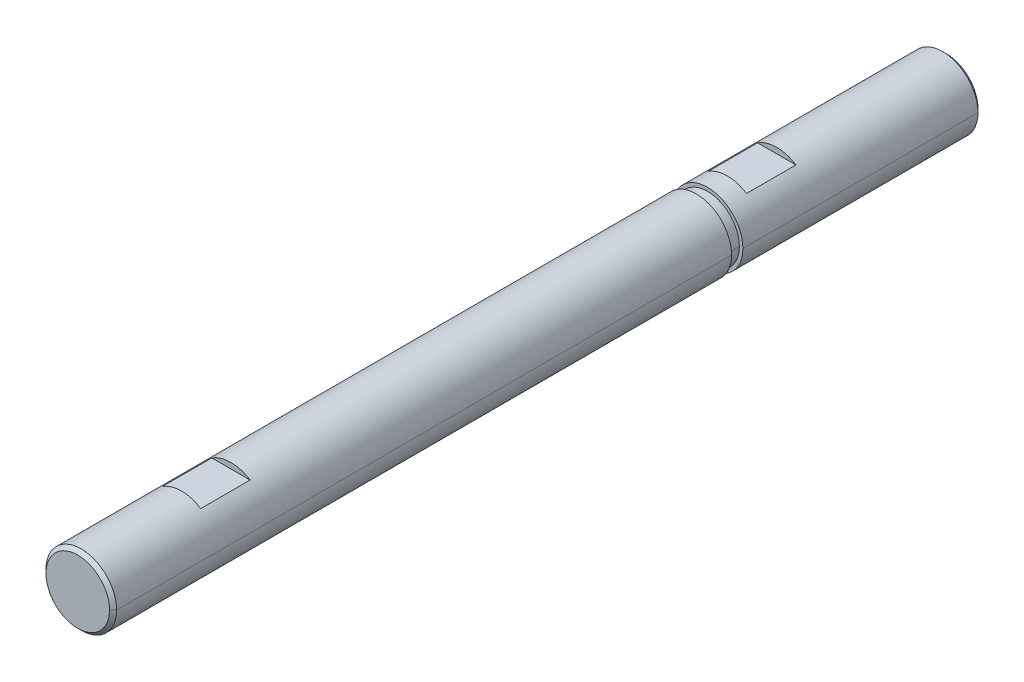
ISO-10303-21;
HEADER;
FILE_DESCRIPTION(('STEP AP214'),'2;1');
FILE_NAME('part.step','',(''),(''),'','','');
FILE_SCHEMA(('AUTOMOTIVE_DESIGN { 1 0 10303 214 1 1 1 1 }'));
ENDSEC;
DATA;
#1=APPLICATION_CONTEXT('core data for automotive mechanical design processes');
#2=APPLICATION_PROTOCOL_DEFINITION('international standard','automotive_design',2000,#1);
#3=PRODUCT_CONTEXT('',#1,'mechanical');
#4=PRODUCT('Part','Part','',(#3));
#5=PRODUCT_RELATED_PRODUCT_CATEGORY('part','',(#4));
#6=PRODUCT_DEFINITION_FORMATION('','',#4);
#7=PRODUCT_DEFINITION_CONTEXT('part definition',#1,'design');
#8=PRODUCT_DEFINITION('design','',#6,#7);
#9=PRODUCT_DEFINITION_SHAPE('','',#8);
#10=(LENGTH_UNIT() NAMED_UNIT(*) SI_UNIT(.MILLI.,.METRE.));
#11=(NAMED_UNIT(*) PLANE_ANGLE_UNIT() SI_UNIT($,.RADIAN.));
#12=(NAMED_UNIT(*) SI_UNIT($,.STERADIAN.) SOLID_ANGLE_UNIT());
#13=UNCERTAINTY_MEASURE_WITH_UNIT(LENGTH_MEASURE(1.E-05),#10,'distance_accuracy_value','');
#14=(GEOMETRIC_REPRESENTATION_CONTEXT(3) GLOBAL_UNCERTAINTY_ASSIGNED_CONTEXT((#13)) GLOBAL_UNIT_ASSIGNED_CONTEXT((#10,
#11,#12)) REPRESENTATION_CONTEXT('',''));
#15=CARTESIAN_POINT('',(0.,0.,0.));
#16=DIRECTION('',(0.,0.,1.));
#17=DIRECTION('',(1.,0.,0.));
#18=AXIS2_PLACEMENT_3D('',#15,#16,#17);
#19=CARTESIAN_POINT('',(0.,0.,61.5));
#20=DIRECTION('',(0.,0.,-1.));
#21=DIRECTION('',(-1.,0.,0.));
#22=AXIS2_PLACEMENT_3D('',#19,#20,#21);
#23=CYLINDRICAL_SURFACE('',#22,2.5);
#24=DIRECTION('',(0.,0.,-1.));
#25=VECTOR('',#24,1.);
#26=CARTESIAN_POINT('',(2.5,0.,61.5));
#27=LINE('',#26,#25);
#28=CARTESIAN_POINT('',(2.5,0.,16.9));
#29=VERTEX_POINT('',#28);
#30=CARTESIAN_POINT('',(2.5,0.,0.249999999999987));
#31=VERTEX_POINT('',#30);
#32=EDGE_CURVE('E204',#29,#31,#27,.T.);
#33=ORIENTED_EDGE('',*,*,#32,.F.);
#34=CARTESIAN_POINT('',(0.,0.,16.9));
#35=DIRECTION('',(0.,0.,1.));
#36=DIRECTION('',(1.,0.,0.));
#37=AXIS2_PLACEMENT_3D('',#34,#35,#36);
#38=CIRCLE('',#37,2.5);
#39=CARTESIAN_POINT('',(-2.5,0.,16.9));
#40=VERTEX_POINT('',#39);
#41=EDGE_CURVE('E161',#40,#29,#38,.T.);
#42=ORIENTED_EDGE('',*,*,#41,.F.);
#43=DIRECTION('',(0.,0.,-1.));
#44=VECTOR('',#43,1.);
#45=CARTESIAN_POINT('',(-2.5,0.,61.5));
#46=LINE('',#45,#44);
#47=CARTESIAN_POINT('',(-2.5,0.,0.249999999999987));
#48=VERTEX_POINT('',#47);
#49=EDGE_CURVE('E203',#40,#48,#46,.T.);
#50=ORIENTED_EDGE('',*,*,#49,.T.);
#51=CARTESIAN_POINT('',(0.,0.,0.249999999999987));
#52=DIRECTION('',(0.,0.,1.));
#53=DIRECTION('',(1.,0.,0.));
#54=AXIS2_PLACEMENT_3D('',#51,#52,#53);
#55=CIRCLE('',#54,2.5);
#56=EDGE_CURVE('E11',#48,#31,#55,.T.);
#57=ORIENTED_EDGE('',*,*,#56,.T.);
#58=EDGE_LOOP('',(#33,#42,#50,#57));
#59=FACE_BOUND('',#58,.T.);
#60=ADVANCED_FACE('F17',(#59),#23,.T.);
#61=CARTESIAN_POINT('',(0.,0.,0.249999999999987));
#62=DIRECTION('',(0.,0.,1.));
#63=DIRECTION('',(1.,0.,0.));
#64=AXIS2_PLACEMENT_3D('',#61,#62,#63);
#65=CONICAL_SURFACE('',#64,2.5,0.785398163397457);
#66=DIRECTION('',(-0.707106781186554,0.,0.707106781186541));
#67=VECTOR('',#66,1.);
#68=CARTESIAN_POINT('',(-2.5,0.,0.249999999999987));
#69=LINE('',#68,#67);
#70=CARTESIAN_POINT('',(-2.25,0.,0.));
#71=VERTEX_POINT('',#70);
#72=EDGE_CURVE('E181',#71,#48,#69,.T.);
#73=ORIENTED_EDGE('',*,*,#72,.F.);
#74=CARTESIAN_POINT('',(0.,0.,0.));
#75=DIRECTION('',(0.,0.,-1.));
#76=DIRECTION('',(1.,0.,0.));
#77=AXIS2_PLACEMENT_3D('',#74,#75,#76);
#78=CIRCLE('',#77,2.25);
#79=CARTESIAN_POINT('',(2.25,0.,0.));
#80=VERTEX_POINT('',#79);
#81=EDGE_CURVE('E88',#80,#71,#78,.T.);
#82=ORIENTED_EDGE('',*,*,#81,.F.);
#83=DIRECTION('',(0.707106781186554,0.,0.707106781186541));
#84=VECTOR('',#83,1.);
#85=CARTESIAN_POINT('',(2.5,0.,0.249999999999987));
#86=LINE('',#85,#84);
#87=EDGE_CURVE('E177',#80,#31,#86,.T.);
#88=ORIENTED_EDGE('',*,*,#87,.T.);
#89=ORIENTED_EDGE('',*,*,#56,.F.);
#90=EDGE_LOOP('',(#73,#82,#88,#89));
#91=FACE_BOUND('',#90,.T.);
#92=ADVANCED_FACE('F338',(#91),#65,.T.);
#93=CARTESIAN_POINT('',(-2.5,3.44225365935192,15.5));
#94=DIRECTION('',(0.,0.,1.));
#95=DIRECTION('',(1.,0.,0.));
#96=AXIS2_PLACEMENT_3D('',#93,#94,#95);
#97=PLANE('',#96);
#98=DIRECTION('',(1.,0.,0.));
#99=VECTOR('',#98,1.);
#100=CARTESIAN_POINT('',(-2.5,2.1,15.5));
#101=LINE('',#100,#99);
#102=CARTESIAN_POINT('',(-1.35646599662505,2.1,15.5));
#103=VERTEX_POINT('',#102);
#104=CARTESIAN_POINT('',(1.35646599662505,2.1,15.5));
#105=VERTEX_POINT('',#104);
#106=EDGE_CURVE('E28',#103,#105,#101,.T.);
#107=ORIENTED_EDGE('',*,*,#106,.F.);
#108=CARTESIAN_POINT('',(0.,0.,15.5));
#109=DIRECTION('',(0.,0.,1.));
#110=DIRECTION('',(1.,0.,0.));
#111=AXIS2_PLACEMENT_3D('',#108,#109,#110);
#112=CIRCLE('',#111,2.5);
#113=EDGE_CURVE('E246',#105,#103,#112,.T.);
#114=ORIENTED_EDGE('',*,*,#113,.F.);
#115=EDGE_LOOP('',(#107,#114));
#116=FACE_BOUND('',#115,.T.);
#117=ADVANCED_FACE('F343',(#116),#97,.F.);
#118=CARTESIAN_POINT('',(-2.5,2.1,15.5));
#119=DIRECTION('',(0.,-1.,0.));
#120=DIRECTION('',(0.,0.,-1.));
#121=AXIS2_PLACEMENT_3D('',#118,#119,#120);
#122=PLANE('',#121);
#123=ORIENTED_EDGE('',*,*,#106,.T.);
#124=DIRECTION('',(0.,0.,1.));
#125=VECTOR('',#124,1.);
#126=CARTESIAN_POINT('',(1.35646599662505,2.1,61.5));
#127=LINE('',#126,#125);
#128=CARTESIAN_POINT('',(1.35646599662505,2.1,12.));
#129=VERTEX_POINT('',#128);
#130=EDGE_CURVE('E247',#129,#105,#127,.T.);
#131=ORIENTED_EDGE('',*,*,#130,.F.);
#132=DIRECTION('',(1.,0.,0.));
#133=VECTOR('',#132,1.);
#134=CARTESIAN_POINT('',(-2.5,2.1,12.));
#135=LINE('',#134,#133);
#136=CARTESIAN_POINT('',(-1.35646599662505,2.1,12.));
#137=VERTEX_POINT('',#136);
#138=EDGE_CURVE('E191',#137,#129,#135,.T.);
#139=ORIENTED_EDGE('',*,*,#138,.F.);
#140=DIRECTION('',(0.,0.,-1.));
#141=VECTOR('',#140,1.);
#142=CARTESIAN_POINT('',(-1.35646599662505,2.1,61.5));
#143=LINE('',#142,#141);
#144=EDGE_CURVE('E257',#103,#137,#143,.T.);
#145=ORIENTED_EDGE('',*,*,#144,.F.);
#146=EDGE_LOOP('',(#123,#131,#139,#145));
#147=FACE_BOUND('',#146,.T.);
#148=ADVANCED_FACE('F363',(#147),#122,.F.);
#149=CARTESIAN_POINT('',(-2.5,3.44225365935192,12.));
#150=DIRECTION('',(0.,0.,-1.));
#151=DIRECTION('',(0.,-1.,0.));
#152=AXIS2_PLACEMENT_3D('',#149,#150,#151);
#153=PLANE('',#152);
#154=ORIENTED_EDGE('',*,*,#138,.T.);
#155=CARTESIAN_POINT('',(0.,0.,12.));
#156=DIRECTION('',(0.,0.,-1.));
#157=DIRECTION('',(-1.,0.,0.));
#158=AXIS2_PLACEMENT_3D('',#155,#156,#157);
#159=CIRCLE('',#158,2.5);
#160=EDGE_CURVE('E252',#137,#129,#159,.T.);
#161=ORIENTED_EDGE('',*,*,#160,.F.);
#162=EDGE_LOOP('',(#154,#161));
#163=FACE_BOUND('',#162,.T.);
#164=ADVANCED_FACE('F360',(#163),#153,.F.);
#165=CARTESIAN_POINT('',(0.,0.,0.));
#166=DIRECTION('',(0.,0.,1.));
#167=DIRECTION('',(1.,0.,0.));
#168=AXIS2_PLACEMENT_3D('',#165,#166,#167);
#169=PLANE('',#168);
#170=ORIENTED_EDGE('',*,*,#81,.T.);
#171=CARTESIAN_POINT('',(0.,0.,0.));
#172=DIRECTION('',(0.,0.,-1.));
#173=DIRECTION('',(1.,0.,0.));
#174=AXIS2_PLACEMENT_3D('',#171,#172,#173);
#175=CIRCLE('',#174,2.25);
#176=EDGE_CURVE('E251',#71,#80,#175,.T.);
#177=ORIENTED_EDGE('',*,*,#176,.T.);
#178=EDGE_LOOP('',(#170,#177));
#179=FACE_BOUND('',#178,.T.);
#180=ADVANCED_FACE('F350',(#179),#169,.F.);
#181=CARTESIAN_POINT('',(0.,0.,64.575));
#182=DIRECTION('',(0.,0.,1.));
#183=DIRECTION('',(1.,0.,0.));
#184=AXIS2_PLACEMENT_3D('',#181,#182,#183);
#185=CYLINDRICAL_SURFACE('',#184,2.25);
#186=DIRECTION('',(0.,0.,1.));
#187=VECTOR('',#186,1.);
#188=CARTESIAN_POINT('',(-2.25,0.,64.575));
#189=LINE('',#188,#187);
#190=CARTESIAN_POINT('',(-2.25,0.,16.9));
#191=VERTEX_POINT('',#190);
#192=CARTESIAN_POINT('',(-2.25,0.,17.7));
#193=VERTEX_POINT('',#192);
#194=EDGE_CURVE('E154',#191,#193,#189,.T.);
#195=ORIENTED_EDGE('',*,*,#194,.F.);
#196=CARTESIAN_POINT('',(0.,0.,16.9));
#197=DIRECTION('',(0.,0.,1.));
#198=DIRECTION('',(1.,0.,0.));
#199=AXIS2_PLACEMENT_3D('',#196,#197,#198);
#200=CIRCLE('',#199,2.25);
#201=CARTESIAN_POINT('',(2.25,0.,16.9));
#202=VERTEX_POINT('',#201);
#203=EDGE_CURVE('E192',#191,#202,#200,.T.);
#204=ORIENTED_EDGE('',*,*,#203,.T.);
#205=DIRECTION('',(0.,0.,1.));
#206=VECTOR('',#205,1.);
#207=CARTESIAN_POINT('',(2.25,0.,64.575));
#208=LINE('',#207,#206);
#209=CARTESIAN_POINT('',(2.25,0.,17.7));
#210=VERTEX_POINT('',#209);
#211=EDGE_CURVE('E157',#202,#210,#208,.T.);
#212=ORIENTED_EDGE('',*,*,#211,.T.);
#213=CARTESIAN_POINT('',(0.,0.,17.7));
#214=DIRECTION('',(0.,0.,1.));
#215=DIRECTION('',(1.,0.,0.));
#216=AXIS2_PLACEMENT_3D('',#213,#214,#215);
#217=CIRCLE('',#216,2.25);
#218=EDGE_CURVE('E21',#193,#210,#217,.T.);
#219=ORIENTED_EDGE('',*,*,#218,.F.);
#220=EDGE_LOOP('',(#195,#204,#212,#219));
#221=FACE_BOUND('',#220,.T.);
#222=ADVANCED_FACE('F152',(#221),#185,.T.);
#223=CARTESIAN_POINT('',(0.,3.3259542693505,16.9));
#224=DIRECTION('',(0.,0.,1.));
#225=DIRECTION('',(1.,0.,0.));
#226=AXIS2_PLACEMENT_3D('',#223,#224,#225);
#227=PLANE('',#226);
#228=CARTESIAN_POINT('',(0.,0.,16.9));
#229=DIRECTION('',(0.,0.,1.));
#230=DIRECTION('',(1.,0.,0.));
#231=AXIS2_PLACEMENT_3D('',#228,#229,#230);
#232=CIRCLE('',#231,2.25);
#233=EDGE_CURVE('E170',#202,#191,#232,.T.);
#234=ORIENTED_EDGE('',*,*,#233,.F.);
#235=ORIENTED_EDGE('',*,*,#203,.F.);
#236=EDGE_LOOP('',(#234,#235));
#237=FACE_BOUND('',#236,.T.);
#238=ORIENTED_EDGE('',*,*,#41,.T.);
#239=CARTESIAN_POINT('',(0.,0.,16.9));
#240=DIRECTION('',(0.,0.,1.));
#241=DIRECTION('',(1.,0.,0.));
#242=AXIS2_PLACEMENT_3D('',#239,#240,#241);
#243=CIRCLE('',#242,2.5);
#244=EDGE_CURVE('E236',#29,#40,#243,.T.);
#245=ORIENTED_EDGE('',*,*,#244,.T.);
#246=EDGE_LOOP('',(#238,#245));
#247=FACE_BOUND('',#246,.T.);
#248=ADVANCED_FACE('F323',(#237,#247),#227,.T.);
#249=CARTESIAN_POINT('',(0.,3.3259542693505,17.7));
#250=DIRECTION('',(0.,0.,-1.));
#251=DIRECTION('',(0.,-1.,0.));
#252=AXIS2_PLACEMENT_3D('',#249,#250,#251);
#253=PLANE('',#252);
#254=CARTESIAN_POINT('',(0.,0.,17.7));
#255=DIRECTION('',(0.,0.,1.));
#256=DIRECTION('',(1.,0.,0.));
#257=AXIS2_PLACEMENT_3D('',#254,#255,#256);
#258=CIRCLE('',#257,2.25);
#259=EDGE_CURVE('E162',#210,#193,#258,.T.);
#260=ORIENTED_EDGE('',*,*,#259,.T.);
#261=ORIENTED_EDGE('',*,*,#218,.T.);
#262=EDGE_LOOP('',(#260,#261));
#263=FACE_BOUND('',#262,.T.);
#264=CARTESIAN_POINT('',(0.,0.,17.7));
#265=DIRECTION('',(0.,0.,-1.));
#266=DIRECTION('',(-1.,0.,0.));
#267=AXIS2_PLACEMENT_3D('',#264,#265,#266);
#268=CIRCLE('',#267,2.5);
#269=CARTESIAN_POINT('',(-2.5,0.,17.7));
#270=VERTEX_POINT('',#269);
#271=CARTESIAN_POINT('',(2.5,0.,17.7));
#272=VERTEX_POINT('',#271);
#273=EDGE_CURVE('E188',#270,#272,#268,.T.);
#274=ORIENTED_EDGE('',*,*,#273,.T.);
#275=CARTESIAN_POINT('',(0.,0.,17.7));
#276=DIRECTION('',(0.,0.,-1.));
#277=DIRECTION('',(-1.,0.,0.));
#278=AXIS2_PLACEMENT_3D('',#275,#276,#277);
#279=CIRCLE('',#278,2.5);
#280=EDGE_CURVE('E243',#272,#270,#279,.T.);
#281=ORIENTED_EDGE('',*,*,#280,.T.);
#282=EDGE_LOOP('',(#274,#281));
#283=FACE_BOUND('',#282,.T.);
#284=ADVANCED_FACE('F163',(#263,#283),#253,.T.);
#285=CARTESIAN_POINT('',(-2.5,2.1,54.15));
#286=DIRECTION('',(0.,-1.,0.));
#287=DIRECTION('',(0.,0.,-1.));
#288=AXIS2_PLACEMENT_3D('',#285,#286,#287);
#289=PLANE('',#288);
#290=DIRECTION('',(1.,0.,0.));
#291=VECTOR('',#290,1.);
#292=CARTESIAN_POINT('',(-2.5,2.1,54.15));
#293=LINE('',#292,#291);
#294=CARTESIAN_POINT('',(-1.35646599662505,2.1,54.15));
#295=VERTEX_POINT('',#294);
#296=CARTESIAN_POINT('',(1.35646599662505,2.1,54.15));
#297=VERTEX_POINT('',#296);
#298=EDGE_CURVE('E215',#295,#297,#293,.T.);
#299=ORIENTED_EDGE('',*,*,#298,.T.);
#300=DIRECTION('',(0.,0.,1.));
#301=VECTOR('',#300,1.);
#302=CARTESIAN_POINT('',(1.35646599662505,2.1,61.5));
#303=LINE('',#302,#301);
#304=CARTESIAN_POINT('',(1.35646599662505,2.1,50.65));
#305=VERTEX_POINT('',#304);
#306=EDGE_CURVE('E229',#305,#297,#303,.T.);
#307=ORIENTED_EDGE('',*,*,#306,.F.);
#308=DIRECTION('',(1.,0.,0.));
#309=VECTOR('',#308,1.);
#310=CARTESIAN_POINT('',(-2.5,2.1,50.65));
#311=LINE('',#310,#309);
#312=CARTESIAN_POINT('',(-1.35646599662505,2.1,50.65));
#313=VERTEX_POINT('',#312);
#314=EDGE_CURVE('E42',#313,#305,#311,.T.);
#315=ORIENTED_EDGE('',*,*,#314,.F.);
#316=DIRECTION('',(0.,0.,-1.));
#317=VECTOR('',#316,1.);
#318=CARTESIAN_POINT('',(-1.35646599662505,2.1,61.5));
#319=LINE('',#318,#317);
#320=EDGE_CURVE('E205',#295,#313,#319,.T.);
#321=ORIENTED_EDGE('',*,*,#320,.F.);
#322=EDGE_LOOP('',(#299,#307,#315,#321));
#323=FACE_BOUND('',#322,.T.);
#324=ADVANCED_FACE('F322',(#323),#289,.F.);
#325=CARTESIAN_POINT('',(-2.5,3.44225365935192,50.65));
#326=DIRECTION('',(0.,0.,-1.));
#327=DIRECTION('',(0.,-1.,0.));
#328=AXIS2_PLACEMENT_3D('',#325,#326,#327);
#329=PLANE('',#328);
#330=ORIENTED_EDGE('',*,*,#314,.T.);
#331=CARTESIAN_POINT('',(0.,0.,50.65));
#332=DIRECTION('',(0.,0.,-1.));
#333=DIRECTION('',(-1.,0.,0.));
#334=AXIS2_PLACEMENT_3D('',#331,#332,#333);
#335=CIRCLE('',#334,2.5);
#336=EDGE_CURVE('E209',#313,#305,#335,.T.);
#337=ORIENTED_EDGE('',*,*,#336,.F.);
#338=EDGE_LOOP('',(#330,#337));
#339=FACE_BOUND('',#338,.T.);
#340=ADVANCED_FACE('F330',(#339),#329,.F.);
#341=CARTESIAN_POINT('',(-2.5,3.44225365935192,54.15));
#342=DIRECTION('',(0.,0.,1.));
#343=DIRECTION('',(1.,0.,0.));
#344=AXIS2_PLACEMENT_3D('',#341,#342,#343);
#345=PLANE('',#344);
#346=ORIENTED_EDGE('',*,*,#298,.F.);
#347=CARTESIAN_POINT('',(0.,0.,54.15));
#348=DIRECTION('',(0.,0.,1.));
#349=DIRECTION('',(1.,0.,0.));
#350=AXIS2_PLACEMENT_3D('',#347,#348,#349);
#351=CIRCLE('',#350,2.5);
#352=EDGE_CURVE('E187',#297,#295,#351,.T.);
#353=ORIENTED_EDGE('',*,*,#352,.F.);
#354=EDGE_LOOP('',(#346,#353));
#355=FACE_BOUND('',#354,.T.);
#356=ADVANCED_FACE('F351',(#355),#345,.F.);
#357=CARTESIAN_POINT('',(0.,0.,61.5));
#358=DIRECTION('',(0.,0.,-1.));
#359=DIRECTION('',(-1.,0.,0.));
#360=AXIS2_PLACEMENT_3D('',#357,#358,#359);
#361=CONICAL_SURFACE('',#360,2.25,0.785398163397457);
#362=DIRECTION('',(0.707106781186554,0.,-0.707106781186541));
#363=VECTOR('',#362,1.);
#364=CARTESIAN_POINT('',(2.25,0.,61.5));
#365=LINE('',#364,#363);
#366=CARTESIAN_POINT('',(2.25,0.,61.5));
#367=VERTEX_POINT('',#366);
#368=CARTESIAN_POINT('',(2.5,0.,61.25));
#369=VERTEX_POINT('',#368);
#370=EDGE_CURVE('E275',#367,#369,#365,.T.);
#371=ORIENTED_EDGE('',*,*,#370,.F.);
#372=CARTESIAN_POINT('',(0.,0.,61.5));
#373=DIRECTION('',(0.,0.,1.));
#374=DIRECTION('',(1.,0.,0.));
#375=AXIS2_PLACEMENT_3D('',#372,#373,#374);
#376=CIRCLE('',#375,2.25);
#377=CARTESIAN_POINT('',(-2.25,0.,61.5));
#378=VERTEX_POINT('',#377);
#379=EDGE_CURVE('E240',#378,#367,#376,.T.);
#380=ORIENTED_EDGE('',*,*,#379,.F.);
#381=DIRECTION('',(-0.707106781186554,0.,-0.707106781186541));
#382=VECTOR('',#381,1.);
#383=CARTESIAN_POINT('',(-2.25,0.,61.5));
#384=LINE('',#383,#382);
#385=CARTESIAN_POINT('',(-2.5,0.,61.25));
#386=VERTEX_POINT('',#385);
#387=EDGE_CURVE('E193',#378,#386,#384,.T.);
#388=ORIENTED_EDGE('',*,*,#387,.T.);
#389=CARTESIAN_POINT('',(0.,0.,61.25));
#390=DIRECTION('',(0.,0.,-1.));
#391=DIRECTION('',(1.,0.,0.));
#392=AXIS2_PLACEMENT_3D('',#389,#390,#391);
#393=CIRCLE('',#392,2.5);
#394=EDGE_CURVE('E277',#369,#386,#393,.T.);
#395=ORIENTED_EDGE('',*,*,#394,.F.);
#396=EDGE_LOOP('',(#371,#380,#388,#395));
#397=FACE_BOUND('',#396,.T.);
#398=ADVANCED_FACE('F314',(#397),#361,.T.);
#399=CARTESIAN_POINT('',(0.,0.,61.5));
#400=DIRECTION('',(0.,0.,1.));
#401=DIRECTION('',(1.,0.,0.));
#402=AXIS2_PLACEMENT_3D('',#399,#400,#401);
#403=PLANE('',#402);
#404=ORIENTED_EDGE('',*,*,#379,.T.);
#405=CARTESIAN_POINT('',(0.,0.,61.5));
#406=DIRECTION('',(0.,0.,1.));
#407=DIRECTION('',(1.,0.,0.));
#408=AXIS2_PLACEMENT_3D('',#405,#406,#407);
#409=CIRCLE('',#408,2.25);
#410=EDGE_CURVE('E220',#367,#378,#409,.T.);
#411=ORIENTED_EDGE('',*,*,#410,.T.);
#412=EDGE_LOOP('',(#404,#411));
#413=FACE_BOUND('',#412,.T.);
#414=ADVANCED_FACE('F358',(#413),#403,.T.);
#415=CARTESIAN_POINT('',(0.,0.,61.5));
#416=DIRECTION('',(0.,0.,-1.));
#417=DIRECTION('',(-1.,0.,0.));
#418=AXIS2_PLACEMENT_3D('',#415,#416,#417);
#419=CYLINDRICAL_SURFACE('',#418,2.5);
#420=DIRECTION('',(0.,0.,-1.));
#421=VECTOR('',#420,1.);
#422=CARTESIAN_POINT('',(2.5,0.,61.5));
#423=LINE('',#422,#421);
#424=EDGE_CURVE('E197',#369,#272,#423,.T.);
#425=ORIENTED_EDGE('',*,*,#424,.F.);
#426=ORIENTED_EDGE('',*,*,#394,.T.);
#427=DIRECTION('',(0.,0.,-1.));
#428=VECTOR('',#427,1.);
#429=CARTESIAN_POINT('',(-2.5,0.,61.5));
#430=LINE('',#429,#428);
#431=EDGE_CURVE('E183',#386,#270,#430,.T.);
#432=ORIENTED_EDGE('',*,*,#431,.T.);
#433=ORIENTED_EDGE('',*,*,#280,.F.);
#434=EDGE_LOOP('',(#425,#426,#432,#433));
#435=FACE_BOUND('',#434,.T.);
#436=ADVANCED_FACE('F318',(#435),#419,.T.);
#437=CARTESIAN_POINT('',(0.,0.,61.5));
#438=DIRECTION('',(0.,0.,-1.));
#439=DIRECTION('',(-1.,0.,0.));
#440=AXIS2_PLACEMENT_3D('',#437,#438,#439);
#441=CYLINDRICAL_SURFACE('',#440,2.5);
#442=ORIENTED_EDGE('',*,*,#352,.T.);
#443=ORIENTED_EDGE('',*,*,#320,.T.);
#444=ORIENTED_EDGE('',*,*,#336,.T.);
#445=ORIENTED_EDGE('',*,*,#306,.T.);
#446=EDGE_LOOP('',(#442,#443,#444,#445));
#447=FACE_BOUND('',#446,.T.);
#448=CARTESIAN_POINT('',(0.,0.,61.25));
#449=DIRECTION('',(0.,0.,-1.));
#450=DIRECTION('',(1.,0.,0.));
#451=AXIS2_PLACEMENT_3D('',#448,#449,#450);
#452=CIRCLE('',#451,2.5);
#453=EDGE_CURVE('E198',#386,#369,#452,.T.);
#454=ORIENTED_EDGE('',*,*,#453,.T.);
#455=ORIENTED_EDGE('',*,*,#424,.T.);
#456=ORIENTED_EDGE('',*,*,#273,.F.);
#457=ORIENTED_EDGE('',*,*,#431,.F.);
#458=EDGE_LOOP('',(#454,#455,#456,#457));
#459=FACE_BOUND('',#458,.T.);
#460=ADVANCED_FACE('F19',(#447,#459),#441,.T.);
#461=CARTESIAN_POINT('',(0.,0.,61.5));
#462=DIRECTION('',(0.,0.,-1.));
#463=DIRECTION('',(-1.,0.,0.));
#464=AXIS2_PLACEMENT_3D('',#461,#462,#463);
#465=CONICAL_SURFACE('',#464,2.25,0.785398163397457);
#466=ORIENTED_EDGE('',*,*,#410,.F.);
#467=ORIENTED_EDGE('',*,*,#370,.T.);
#468=ORIENTED_EDGE('',*,*,#453,.F.);
#469=ORIENTED_EDGE('',*,*,#387,.F.);
#470=EDGE_LOOP('',(#466,#467,#468,#469));
#471=FACE_BOUND('',#470,.T.);
#472=ADVANCED_FACE('F311',(#471),#465,.T.);
#473=CARTESIAN_POINT('',(0.,0.,64.575));
#474=DIRECTION('',(0.,0.,1.));
#475=DIRECTION('',(1.,0.,0.));
#476=AXIS2_PLACEMENT_3D('',#473,#474,#475);
#477=CYLINDRICAL_SURFACE('',#476,2.25);
#478=ORIENTED_EDGE('',*,*,#233,.T.);
#479=ORIENTED_EDGE('',*,*,#194,.T.);
#480=ORIENTED_EDGE('',*,*,#259,.F.);
#481=ORIENTED_EDGE('',*,*,#211,.F.);
#482=EDGE_LOOP('',(#478,#479,#480,#481));
#483=FACE_BOUND('',#482,.T.);
#484=ADVANCED_FACE('F168',(#483),#477,.T.);
#485=CARTESIAN_POINT('',(0.,0.,0.249999999999987));
#486=DIRECTION('',(0.,0.,1.));
#487=DIRECTION('',(1.,0.,0.));
#488=AXIS2_PLACEMENT_3D('',#485,#486,#487);
#489=CONICAL_SURFACE('',#488,2.5,0.785398163397457);
#490=ORIENTED_EDGE('',*,*,#176,.F.);
#491=ORIENTED_EDGE('',*,*,#72,.T.);
#492=CARTESIAN_POINT('',(0.,0.,0.249999999999987));
#493=DIRECTION('',(0.,0.,1.));
#494=DIRECTION('',(1.,0.,0.));
#495=AXIS2_PLACEMENT_3D('',#492,#493,#494);
#496=CIRCLE('',#495,2.5);
#497=EDGE_CURVE('E199',#31,#48,#496,.T.);
#498=ORIENTED_EDGE('',*,*,#497,.F.);
#499=ORIENTED_EDGE('',*,*,#87,.F.);
#500=EDGE_LOOP('',(#490,#491,#498,#499));
#501=FACE_BOUND('',#500,.T.);
#502=ADVANCED_FACE('F347',(#501),#489,.T.);
#503=CARTESIAN_POINT('',(0.,0.,61.5));
#504=DIRECTION('',(0.,0.,-1.));
#505=DIRECTION('',(-1.,0.,0.));
#506=AXIS2_PLACEMENT_3D('',#503,#504,#505);
#507=CYLINDRICAL_SURFACE('',#506,2.5);
#508=ORIENTED_EDGE('',*,*,#113,.T.);
#509=ORIENTED_EDGE('',*,*,#144,.T.);
#510=ORIENTED_EDGE('',*,*,#160,.T.);
#511=ORIENTED_EDGE('',*,*,#130,.T.);
#512=EDGE_LOOP('',(#508,#509,#510,#511));
#513=FACE_BOUND('',#512,.T.);
#514=ORIENTED_EDGE('',*,*,#244,.F.);
#515=ORIENTED_EDGE('',*,*,#32,.T.);
#516=ORIENTED_EDGE('',*,*,#497,.T.);
#517=ORIENTED_EDGE('',*,*,#49,.F.);
#518=EDGE_LOOP('',(#514,#515,#516,#517));
#519=FACE_BOUND('',#518,.T.);
#520=ADVANCED_FACE('F387',(#513,#519),#507,.T.);
#521=CLOSED_SHELL('',(#60,#92,#117,#148,#164,#180,#222,#248,#284,#324,#340,#356,#398,#414,#436,
#460,#472,#484,#502,#520));
#522=MANIFOLD_SOLID_BREP('B1',#521);
#523=ADVANCED_BREP_SHAPE_REPRESENTATION('',(#18,#522),#14);
#524=SHAPE_DEFINITION_REPRESENTATION(#9,#523);
ENDSEC;
END-ISO-10303-21;
